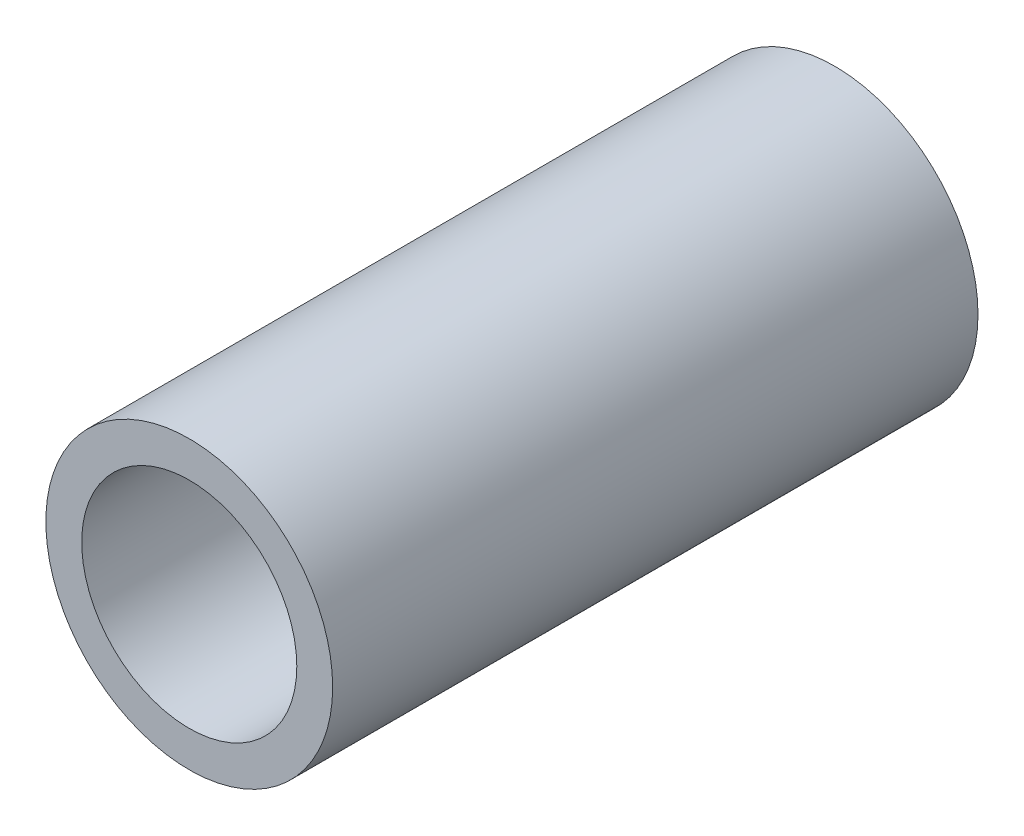
ISO-10303-21;
HEADER;
FILE_DESCRIPTION(('STEP AP214'),'2;1');
FILE_NAME('part.step','',(''),(''),'','','');
FILE_SCHEMA(('AUTOMOTIVE_DESIGN { 1 0 10303 214 1 1 1 1 }'));
ENDSEC;
DATA;
#1=APPLICATION_CONTEXT('core data for automotive mechanical design processes');
#2=APPLICATION_PROTOCOL_DEFINITION('international standard','automotive_design',2000,#1);
#3=PRODUCT_CONTEXT('',#1,'mechanical');
#4=PRODUCT('Part','Part','',(#3));
#5=PRODUCT_RELATED_PRODUCT_CATEGORY('part','',(#4));
#6=PRODUCT_DEFINITION_FORMATION('','',#4);
#7=PRODUCT_DEFINITION_CONTEXT('part definition',#1,'design');
#8=PRODUCT_DEFINITION('design','',#6,#7);
#9=PRODUCT_DEFINITION_SHAPE('','',#8);
#10=(LENGTH_UNIT() NAMED_UNIT(*) SI_UNIT(.MILLI.,.METRE.));
#11=(NAMED_UNIT(*) PLANE_ANGLE_UNIT() SI_UNIT($,.RADIAN.));
#12=(NAMED_UNIT(*) SI_UNIT($,.STERADIAN.) SOLID_ANGLE_UNIT());
#13=UNCERTAINTY_MEASURE_WITH_UNIT(LENGTH_MEASURE(1.E-05),#10,'distance_accuracy_value','');
#14=(GEOMETRIC_REPRESENTATION_CONTEXT(3) GLOBAL_UNCERTAINTY_ASSIGNED_CONTEXT((#13)) GLOBAL_UNIT_ASSIGNED_CONTEXT((#10,
#11,#12)) REPRESENTATION_CONTEXT('',''));
#15=CARTESIAN_POINT('',(0.,0.,0.));
#16=DIRECTION('',(0.,0.,1.));
#17=DIRECTION('',(1.,0.,0.));
#18=AXIS2_PLACEMENT_3D('',#15,#16,#17);
#19=CARTESIAN_POINT('',(0.,0.,9.));
#20=DIRECTION('',(0.,0.,1.));
#21=DIRECTION('',(1.,0.,0.));
#22=AXIS2_PLACEMENT_3D('',#19,#20,#21);
#23=PLANE('',#22);
#24=CARTESIAN_POINT('',(0.,0.,9.));
#25=DIRECTION('',(0.,0.,1.));
#26=DIRECTION('',(1.,0.,0.));
#27=AXIS2_PLACEMENT_3D('',#24,#25,#26);
#28=CIRCLE('',#27,2.);
#29=CARTESIAN_POINT('',(2.,0.,9.));
#30=VERTEX_POINT('',#29);
#31=EDGE_CURVE('E10',#30,#30,#28,.T.);
#32=ORIENTED_EDGE('',*,*,#31,.T.);
#33=EDGE_LOOP('',(#32));
#34=FACE_BOUND('',#33,.T.);
#35=CARTESIAN_POINT('',(0.,0.,9.));
#36=DIRECTION('',(0.,0.,1.));
#37=DIRECTION('',(1.,0.,0.));
#38=AXIS2_PLACEMENT_3D('',#35,#36,#37);
#39=CIRCLE('',#38,1.5);
#40=CARTESIAN_POINT('',(1.5,0.,9.));
#41=VERTEX_POINT('',#40);
#42=EDGE_CURVE('E42',#41,#41,#39,.T.);
#43=ORIENTED_EDGE('',*,*,#42,.F.);
#44=EDGE_LOOP('',(#43));
#45=FACE_BOUND('',#44,.T.);
#46=ADVANCED_FACE('F31',(#34,#45),#23,.T.);
#47=CARTESIAN_POINT('',(0.,0.,0.));
#48=DIRECTION('',(0.,0.,1.));
#49=DIRECTION('',(1.,0.,0.));
#50=AXIS2_PLACEMENT_3D('',#47,#48,#49);
#51=PLANE('',#50);
#52=CARTESIAN_POINT('',(0.,0.,0.));
#53=DIRECTION('',(0.,0.,1.));
#54=DIRECTION('',(1.,0.,0.));
#55=AXIS2_PLACEMENT_3D('',#52,#53,#54);
#56=CIRCLE('',#55,2.);
#57=CARTESIAN_POINT('',(2.,0.,0.));
#58=VERTEX_POINT('',#57);
#59=EDGE_CURVE('E35',#58,#58,#56,.T.);
#60=ORIENTED_EDGE('',*,*,#59,.F.);
#61=EDGE_LOOP('',(#60));
#62=FACE_BOUND('',#61,.T.);
#63=CARTESIAN_POINT('',(0.,0.,0.));
#64=DIRECTION('',(0.,0.,1.));
#65=DIRECTION('',(1.,0.,0.));
#66=AXIS2_PLACEMENT_3D('',#63,#64,#65);
#67=CIRCLE('',#66,1.5);
#68=CARTESIAN_POINT('',(1.5,0.,0.));
#69=VERTEX_POINT('',#68);
#70=EDGE_CURVE('E44',#69,#69,#67,.T.);
#71=ORIENTED_EDGE('',*,*,#70,.T.);
#72=EDGE_LOOP('',(#71));
#73=FACE_BOUND('',#72,.T.);
#74=ADVANCED_FACE('F54',(#62,#73),#51,.F.);
#75=CARTESIAN_POINT('',(0.,0.,9.));
#76=DIRECTION('',(0.,0.,-1.));
#77=DIRECTION('',(-1.,0.,0.));
#78=AXIS2_PLACEMENT_3D('',#75,#76,#77);
#79=CYLINDRICAL_SURFACE('',#78,2.);
#80=ORIENTED_EDGE('',*,*,#31,.F.);
#81=EDGE_LOOP('',(#80));
#82=FACE_BOUND('',#81,.T.);
#83=ORIENTED_EDGE('',*,*,#59,.T.);
#84=EDGE_LOOP('',(#83));
#85=FACE_BOUND('',#84,.T.);
#86=ADVANCED_FACE('F33',(#82,#85),#79,.T.);
#87=CARTESIAN_POINT('',(0.,0.,9.));
#88=DIRECTION('',(0.,0.,-1.));
#89=DIRECTION('',(-1.,0.,0.));
#90=AXIS2_PLACEMENT_3D('',#87,#88,#89);
#91=CYLINDRICAL_SURFACE('',#90,1.5);
#92=ORIENTED_EDGE('',*,*,#42,.T.);
#93=EDGE_LOOP('',(#92));
#94=FACE_BOUND('',#93,.T.);
#95=ORIENTED_EDGE('',*,*,#70,.F.);
#96=EDGE_LOOP('',(#95));
#97=FACE_BOUND('',#96,.T.);
#98=ADVANCED_FACE('F50',(#94,#97),#91,.F.);
#99=CLOSED_SHELL('',(#46,#74,#86,#98));
#100=MANIFOLD_SOLID_BREP('B2',#99);
#101=ADVANCED_BREP_SHAPE_REPRESENTATION('',(#18,#100),#14);
#102=SHAPE_DEFINITION_REPRESENTATION(#9,#101);
ENDSEC;
END-ISO-10303-21;
